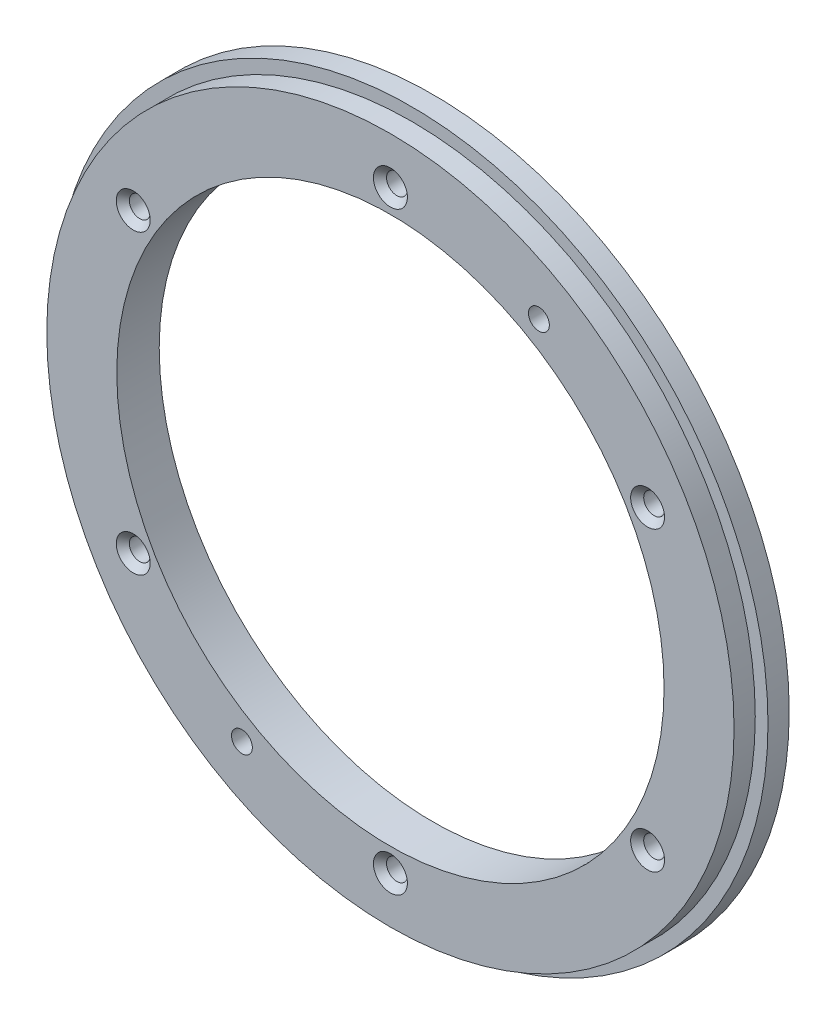
ISO-10303-21;
HEADER;
FILE_DESCRIPTION(('STEP AP214'),'2;1');
FILE_NAME('part.step','',(''),(''),'','','');
FILE_SCHEMA(('AUTOMOTIVE_DESIGN { 1 0 10303 214 1 1 1 1 }'));
ENDSEC;
DATA;
#1=APPLICATION_CONTEXT('core data for automotive mechanical design processes');
#2=APPLICATION_PROTOCOL_DEFINITION('international standard','automotive_design',2000,#1);
#3=PRODUCT_CONTEXT('',#1,'mechanical');
#4=PRODUCT('Part','Part','',(#3));
#5=PRODUCT_RELATED_PRODUCT_CATEGORY('part','',(#4));
#6=PRODUCT_DEFINITION_FORMATION('','',#4);
#7=PRODUCT_DEFINITION_CONTEXT('part definition',#1,'design');
#8=PRODUCT_DEFINITION('design','',#6,#7);
#9=PRODUCT_DEFINITION_SHAPE('','',#8);
#10=(LENGTH_UNIT() NAMED_UNIT(*) SI_UNIT(.MILLI.,.METRE.));
#11=(NAMED_UNIT(*) PLANE_ANGLE_UNIT() SI_UNIT($,.RADIAN.));
#12=(NAMED_UNIT(*) SI_UNIT($,.STERADIAN.) SOLID_ANGLE_UNIT());
#13=UNCERTAINTY_MEASURE_WITH_UNIT(LENGTH_MEASURE(1.E-05),#10,'distance_accuracy_value','');
#14=(GEOMETRIC_REPRESENTATION_CONTEXT(3) GLOBAL_UNCERTAINTY_ASSIGNED_CONTEXT((#13)) GLOBAL_UNIT_ASSIGNED_CONTEXT((#10,
#11,#12)) REPRESENTATION_CONTEXT('',''));
#15=CARTESIAN_POINT('',(0.,0.,0.));
#16=DIRECTION('',(0.,0.,1.));
#17=DIRECTION('',(1.,0.,0.));
#18=AXIS2_PLACEMENT_3D('',#15,#16,#17);
#19=CARTESIAN_POINT('',(0.,0.,2.5));
#20=DIRECTION('',(0.,0.,1.));
#21=DIRECTION('',(1.,0.,0.));
#22=AXIS2_PLACEMENT_3D('',#19,#20,#21);
#23=CYLINDRICAL_SURFACE('',#22,40.5);
#24=CARTESIAN_POINT('',(0.,0.,2.5));
#25=DIRECTION('',(0.,0.,1.));
#26=DIRECTION('',(1.,0.,0.));
#27=AXIS2_PLACEMENT_3D('',#24,#25,#26);
#28=CIRCLE('',#27,40.5);
#29=CARTESIAN_POINT('',(40.5,0.,2.5));
#30=VERTEX_POINT('',#29);
#31=EDGE_CURVE('E62',#30,#30,#28,.T.);
#32=ORIENTED_EDGE('',*,*,#31,.T.);
#33=EDGE_LOOP('',(#32));
#34=FACE_BOUND('',#33,.T.);
#35=CARTESIAN_POINT('',(0.,0.,5.));
#36=DIRECTION('',(0.,0.,1.));
#37=DIRECTION('',(1.,0.,0.));
#38=AXIS2_PLACEMENT_3D('',#35,#36,#37);
#39=CIRCLE('',#38,40.5);
#40=CARTESIAN_POINT('',(40.5,0.,5.));
#41=VERTEX_POINT('',#40);
#42=EDGE_CURVE('E65',#41,#41,#39,.F.);
#43=ORIENTED_EDGE('',*,*,#42,.T.);
#44=EDGE_LOOP('',(#43));
#45=FACE_BOUND('',#44,.T.);
#46=ADVANCED_FACE('F14',(#34,#45),#23,.T.);
#47=CARTESIAN_POINT('',(17.5,30.3108891324553,4.));
#48=DIRECTION('',(0.,0.,-1.));
#49=DIRECTION('',(-1.,0.,0.));
#50=AXIS2_PLACEMENT_3D('',#47,#48,#49);
#51=CYLINDRICAL_SURFACE('',#50,1.2295);
#52=CARTESIAN_POINT('',(17.5,30.3108891324553,0.770500000044194));
#53=DIRECTION('',(0.,0.,-1.));
#54=DIRECTION('',(-1.,0.,0.));
#55=AXIS2_PLACEMENT_3D('',#52,#53,#54);
#56=CIRCLE('',#55,1.22949999998128);
#57=CARTESIAN_POINT('',(16.2705000000187,30.3108891324553,0.770500000044194));
#58=VERTEX_POINT('',#57);
#59=EDGE_CURVE('E29',#58,#58,#56,.T.);
#60=ORIENTED_EDGE('',*,*,#59,.T.);
#61=EDGE_LOOP('',(#60));
#62=FACE_BOUND('',#61,.T.);
#63=CARTESIAN_POINT('',(17.5,30.3108891324553,5.));
#64=DIRECTION('',(0.,0.,-1.));
#65=DIRECTION('',(-1.,0.,0.));
#66=AXIS2_PLACEMENT_3D('',#63,#64,#65);
#67=CIRCLE('',#66,1.2295);
#68=CARTESIAN_POINT('',(16.2705,30.3108891324553,5.));
#69=VERTEX_POINT('',#68);
#70=EDGE_CURVE('E17',#69,#69,#67,.F.);
#71=ORIENTED_EDGE('',*,*,#70,.T.);
#72=EDGE_LOOP('',(#71));
#73=FACE_BOUND('',#72,.T.);
#74=ADVANCED_FACE('F92',(#62,#73),#51,.F.);
#75=CARTESIAN_POINT('',(-17.5,-30.3108891324553,4.));
#76=DIRECTION('',(0.,0.,-1.));
#77=DIRECTION('',(-1.,0.,0.));
#78=AXIS2_PLACEMENT_3D('',#75,#76,#77);
#79=CYLINDRICAL_SURFACE('',#78,1.2295);
#80=CARTESIAN_POINT('',(-17.5,-30.3108891324553,0.770499999987351));
#81=DIRECTION('',(0.,0.,-1.));
#82=DIRECTION('',(-1.,0.,0.));
#83=AXIS2_PLACEMENT_3D('',#80,#81,#82);
#84=CIRCLE('',#83,1.22950000006311);
#85=CARTESIAN_POINT('',(-18.7295000000631,-30.3108891324553,0.770499999987351));
#86=VERTEX_POINT('',#85);
#87=EDGE_CURVE('E165',#86,#86,#84,.T.);
#88=ORIENTED_EDGE('',*,*,#87,.T.);
#89=EDGE_LOOP('',(#88));
#90=FACE_BOUND('',#89,.T.);
#91=CARTESIAN_POINT('',(-17.5,-30.3108891324553,5.));
#92=DIRECTION('',(0.,0.,-1.));
#93=DIRECTION('',(-1.,0.,0.));
#94=AXIS2_PLACEMENT_3D('',#91,#92,#93);
#95=CIRCLE('',#94,1.2295);
#96=CARTESIAN_POINT('',(-18.7295,-30.3108891324553,5.));
#97=VERTEX_POINT('',#96);
#98=EDGE_CURVE('E85',#97,#97,#95,.F.);
#99=ORIENTED_EDGE('',*,*,#98,.T.);
#100=EDGE_LOOP('',(#99));
#101=FACE_BOUND('',#100,.T.);
#102=ADVANCED_FACE('F233',(#90,#101),#79,.F.);
#103=CARTESIAN_POINT('',(-30.3108891324554,-17.5,4.99999999999545));
#104=DIRECTION('',(0.,0.,1.));
#105=DIRECTION('',(1.,0.,0.));
#106=AXIS2_PLACEMENT_3D('',#103,#104,#105);
#107=CONICAL_SURFACE('',#106,1.99999999994257,0.785398163397448);
#108=CARTESIAN_POINT('',(-30.3108891324554,-17.5,4.99999999999545));
#109=DIRECTION('',(0.,0.,1.));
#110=DIRECTION('',(1.,0.,0.));
#111=AXIS2_PLACEMENT_3D('',#108,#109,#110);
#112=CIRCLE('',#111,1.99999999994257);
#113=CARTESIAN_POINT('',(-28.3108891325128,-17.5,4.99999999999545));
#114=VERTEX_POINT('',#113);
#115=EDGE_CURVE('E83',#114,#114,#112,.T.);
#116=ORIENTED_EDGE('',*,*,#115,.T.);
#117=EDGE_LOOP('',(#116));
#118=FACE_BOUND('',#117,.T.);
#119=CARTESIAN_POINT('',(-30.3108891324554,-17.5,4.2295));
#120=DIRECTION('',(0.,0.,1.));
#121=DIRECTION('',(1.,0.,0.));
#122=AXIS2_PLACEMENT_3D('',#119,#120,#121);
#123=CIRCLE('',#122,1.2295);
#124=CARTESIAN_POINT('',(-29.0813891324553,-17.5,4.2295));
#125=VERTEX_POINT('',#124);
#126=EDGE_CURVE('E167',#125,#125,#123,.F.);
#127=ORIENTED_EDGE('',*,*,#126,.T.);
#128=EDGE_LOOP('',(#127));
#129=FACE_BOUND('',#128,.T.);
#130=ADVANCED_FACE('F229',(#118,#129),#107,.F.);
#131=CARTESIAN_POINT('',(30.3108891324554,-17.5,4.99999999999545));
#132=DIRECTION('',(0.,0.,1.));
#133=DIRECTION('',(1.,0.,0.));
#134=AXIS2_PLACEMENT_3D('',#131,#132,#133);
#135=CONICAL_SURFACE('',#134,1.99999999996284,0.785398163397448);
#136=CARTESIAN_POINT('',(30.3108891324554,-17.5,4.99999999999545));
#137=DIRECTION('',(0.,0.,1.));
#138=DIRECTION('',(1.,0.,0.));
#139=AXIS2_PLACEMENT_3D('',#136,#137,#138);
#140=CIRCLE('',#139,1.99999999996284);
#141=CARTESIAN_POINT('',(32.3108891324182,-17.5,4.99999999999545));
#142=VERTEX_POINT('',#141);
#143=EDGE_CURVE('E80',#142,#142,#140,.T.);
#144=ORIENTED_EDGE('',*,*,#143,.T.);
#145=EDGE_LOOP('',(#144));
#146=FACE_BOUND('',#145,.T.);
#147=CARTESIAN_POINT('',(30.3108891324554,-17.5,4.2295));
#148=DIRECTION('',(0.,0.,1.));
#149=DIRECTION('',(1.,0.,0.));
#150=AXIS2_PLACEMENT_3D('',#147,#148,#149);
#151=CIRCLE('',#150,1.2295);
#152=CARTESIAN_POINT('',(31.5403891324554,-17.5,4.2295));
#153=VERTEX_POINT('',#152);
#154=EDGE_CURVE('E171',#153,#153,#151,.F.);
#155=ORIENTED_EDGE('',*,*,#154,.T.);
#156=EDGE_LOOP('',(#155));
#157=FACE_BOUND('',#156,.T.);
#158=ADVANCED_FACE('F225',(#146,#157),#135,.F.);
#159=CARTESIAN_POINT('',(0.,35.,4.99999999999545));
#160=DIRECTION('',(0.,0.,1.));
#161=DIRECTION('',(1.,0.,0.));
#162=AXIS2_PLACEMENT_3D('',#159,#160,#161);
#163=CONICAL_SURFACE('',#162,2.00000000000955,0.785398163434336);
#164=CARTESIAN_POINT('',(0.,35.,4.99999999999545));
#165=DIRECTION('',(0.,0.,1.));
#166=DIRECTION('',(1.,0.,0.));
#167=AXIS2_PLACEMENT_3D('',#164,#165,#166);
#168=CIRCLE('',#167,2.00000000000955);
#169=CARTESIAN_POINT('',(2.00000000000955,35.,4.99999999999545));
#170=VERTEX_POINT('',#169);
#171=EDGE_CURVE('E77',#170,#170,#168,.T.);
#172=ORIENTED_EDGE('',*,*,#171,.T.);
#173=EDGE_LOOP('',(#172));
#174=FACE_BOUND('',#173,.T.);
#175=CARTESIAN_POINT('',(0.,35.,4.2295));
#176=DIRECTION('',(0.,0.,1.));
#177=DIRECTION('',(1.,0.,0.));
#178=AXIS2_PLACEMENT_3D('',#175,#176,#177);
#179=CIRCLE('',#178,1.2295);
#180=CARTESIAN_POINT('',(1.2295,35.,4.2295));
#181=VERTEX_POINT('',#180);
#182=EDGE_CURVE('E176',#181,#181,#179,.F.);
#183=ORIENTED_EDGE('',*,*,#182,.T.);
#184=EDGE_LOOP('',(#183));
#185=FACE_BOUND('',#184,.T.);
#186=ADVANCED_FACE('F219',(#174,#185),#163,.F.);
#187=CARTESIAN_POINT('',(30.3108891324554,17.5,4.99999999999545));
#188=DIRECTION('',(0.,0.,1.));
#189=DIRECTION('',(1.,0.,0.));
#190=AXIS2_PLACEMENT_3D('',#187,#188,#189);
#191=CONICAL_SURFACE('',#190,1.99999999996285,0.785398163397448);
#192=CARTESIAN_POINT('',(30.3108891324554,17.5,4.99999999999545));
#193=DIRECTION('',(0.,0.,1.));
#194=DIRECTION('',(1.,0.,0.));
#195=AXIS2_PLACEMENT_3D('',#192,#193,#194);
#196=CIRCLE('',#195,1.99999999996285);
#197=CARTESIAN_POINT('',(32.3108891324182,17.5,4.99999999999545));
#198=VERTEX_POINT('',#197);
#199=EDGE_CURVE('E74',#198,#198,#196,.T.);
#200=ORIENTED_EDGE('',*,*,#199,.T.);
#201=EDGE_LOOP('',(#200));
#202=FACE_BOUND('',#201,.T.);
#203=CARTESIAN_POINT('',(30.3108891324554,17.5,4.2295));
#204=DIRECTION('',(0.,0.,1.));
#205=DIRECTION('',(1.,0.,0.));
#206=AXIS2_PLACEMENT_3D('',#203,#204,#205);
#207=CIRCLE('',#206,1.2295);
#208=CARTESIAN_POINT('',(31.5403891324553,17.5,4.2295));
#209=VERTEX_POINT('',#208);
#210=EDGE_CURVE('E179',#209,#209,#207,.F.);
#211=ORIENTED_EDGE('',*,*,#210,.T.);
#212=EDGE_LOOP('',(#211));
#213=FACE_BOUND('',#212,.T.);
#214=ADVANCED_FACE('F213',(#202,#213),#191,.F.);
#215=CARTESIAN_POINT('',(0.,-35.,4.99999999999545));
#216=DIRECTION('',(0.,0.,1.));
#217=DIRECTION('',(1.,0.,0.));
#218=AXIS2_PLACEMENT_3D('',#215,#216,#217);
#219=CONICAL_SURFACE('',#218,2.00000000000955,0.785398163434336);
#220=CARTESIAN_POINT('',(0.,-35.,4.99999999999545));
#221=DIRECTION('',(0.,0.,1.));
#222=DIRECTION('',(1.,0.,0.));
#223=AXIS2_PLACEMENT_3D('',#220,#221,#222);
#224=CIRCLE('',#223,2.00000000000955);
#225=CARTESIAN_POINT('',(2.00000000000955,-35.,4.99999999999545));
#226=VERTEX_POINT('',#225);
#227=EDGE_CURVE('E71',#226,#226,#224,.T.);
#228=ORIENTED_EDGE('',*,*,#227,.T.);
#229=EDGE_LOOP('',(#228));
#230=FACE_BOUND('',#229,.T.);
#231=CARTESIAN_POINT('',(0.,-35.,4.2295));
#232=DIRECTION('',(0.,0.,1.));
#233=DIRECTION('',(1.,0.,0.));
#234=AXIS2_PLACEMENT_3D('',#231,#232,#233);
#235=CIRCLE('',#234,1.2295);
#236=CARTESIAN_POINT('',(1.2295,-35.,4.2295));
#237=VERTEX_POINT('',#236);
#238=EDGE_CURVE('E182',#237,#237,#235,.F.);
#239=ORIENTED_EDGE('',*,*,#238,.T.);
#240=EDGE_LOOP('',(#239));
#241=FACE_BOUND('',#240,.T.);
#242=ADVANCED_FACE('F108',(#230,#241),#219,.F.);
#243=CARTESIAN_POINT('',(-30.3108891324554,17.5,4.99999999999545));
#244=DIRECTION('',(0.,0.,1.));
#245=DIRECTION('',(1.,0.,0.));
#246=AXIS2_PLACEMENT_3D('',#243,#244,#245);
#247=CONICAL_SURFACE('',#246,1.99999999994257,0.785398163397448);
#248=CARTESIAN_POINT('',(-30.3108891324554,17.5,4.99999999999545));
#249=DIRECTION('',(0.,0.,1.));
#250=DIRECTION('',(1.,0.,0.));
#251=AXIS2_PLACEMENT_3D('',#248,#249,#250);
#252=CIRCLE('',#251,1.99999999994257);
#253=CARTESIAN_POINT('',(-28.3108891325128,17.5,4.99999999999545));
#254=VERTEX_POINT('',#253);
#255=EDGE_CURVE('E68',#254,#254,#252,.T.);
#256=ORIENTED_EDGE('',*,*,#255,.T.);
#257=EDGE_LOOP('',(#256));
#258=FACE_BOUND('',#257,.T.);
#259=CARTESIAN_POINT('',(-30.3108891324554,17.5,4.2295));
#260=DIRECTION('',(0.,0.,1.));
#261=DIRECTION('',(1.,0.,0.));
#262=AXIS2_PLACEMENT_3D('',#259,#260,#261);
#263=CIRCLE('',#262,1.2295);
#264=CARTESIAN_POINT('',(-29.0813891324554,17.5,4.2295));
#265=VERTEX_POINT('',#264);
#266=EDGE_CURVE('E61',#265,#265,#263,.F.);
#267=ORIENTED_EDGE('',*,*,#266,.T.);
#268=EDGE_LOOP('',(#267));
#269=FACE_BOUND('',#268,.T.);
#270=ADVANCED_FACE('F97',(#258,#269),#247,.F.);
#271=CARTESIAN_POINT('',(0.,0.,5.));
#272=DIRECTION('',(0.,0.,-1.));
#273=DIRECTION('',(-1.,0.,0.));
#274=AXIS2_PLACEMENT_3D('',#271,#272,#273);
#275=PLANE('',#274);
#276=ORIENTED_EDGE('',*,*,#42,.F.);
#277=EDGE_LOOP('',(#276));
#278=FACE_BOUND('',#277,.T.);
#279=CARTESIAN_POINT('',(0.,0.,5.));
#280=DIRECTION('',(0.,0.,1.));
#281=DIRECTION('',(1.,0.,0.));
#282=AXIS2_PLACEMENT_3D('',#279,#280,#281);
#283=CIRCLE('',#282,32.25);
#284=CARTESIAN_POINT('',(32.25,0.,5.));
#285=VERTEX_POINT('',#284);
#286=EDGE_CURVE('E58',#285,#285,#283,.F.);
#287=ORIENTED_EDGE('',*,*,#286,.T.);
#288=EDGE_LOOP('',(#287));
#289=FACE_BOUND('',#288,.T.);
#290=ORIENTED_EDGE('',*,*,#255,.F.);
#291=EDGE_LOOP('',(#290));
#292=FACE_BOUND('',#291,.T.);
#293=ORIENTED_EDGE('',*,*,#227,.F.);
#294=EDGE_LOOP('',(#293));
#295=FACE_BOUND('',#294,.T.);
#296=ORIENTED_EDGE('',*,*,#199,.F.);
#297=EDGE_LOOP('',(#296));
#298=FACE_BOUND('',#297,.T.);
#299=ORIENTED_EDGE('',*,*,#171,.F.);
#300=EDGE_LOOP('',(#299));
#301=FACE_BOUND('',#300,.T.);
#302=ORIENTED_EDGE('',*,*,#143,.F.);
#303=EDGE_LOOP('',(#302));
#304=FACE_BOUND('',#303,.T.);
#305=ORIENTED_EDGE('',*,*,#115,.F.);
#306=EDGE_LOOP('',(#305));
#307=FACE_BOUND('',#306,.T.);
#308=ORIENTED_EDGE('',*,*,#98,.F.);
#309=EDGE_LOOP('',(#308));
#310=FACE_BOUND('',#309,.T.);
#311=ORIENTED_EDGE('',*,*,#70,.F.);
#312=EDGE_LOOP('',(#311));
#313=FACE_BOUND('',#312,.T.);
#314=ADVANCED_FACE('F94',(#278,#289,#292,#295,#298,#301,#304,#307,#310,#313),#275,.F.);
#315=CARTESIAN_POINT('',(0.,0.,2.5));
#316=DIRECTION('',(0.,0.,-1.));
#317=DIRECTION('',(-1.,0.,0.));
#318=AXIS2_PLACEMENT_3D('',#315,#316,#317);
#319=PLANE('',#318);
#320=CARTESIAN_POINT('',(0.,0.,2.5));
#321=DIRECTION('',(0.,0.,1.));
#322=DIRECTION('',(1.,0.,0.));
#323=AXIS2_PLACEMENT_3D('',#320,#321,#322);
#324=CIRCLE('',#323,42.);
#325=CARTESIAN_POINT('',(42.,0.,2.5));
#326=VERTEX_POINT('',#325);
#327=EDGE_CURVE('E55',#326,#326,#324,.F.);
#328=ORIENTED_EDGE('',*,*,#327,.F.);
#329=EDGE_LOOP('',(#328));
#330=FACE_BOUND('',#329,.T.);
#331=ORIENTED_EDGE('',*,*,#31,.F.);
#332=EDGE_LOOP('',(#331));
#333=FACE_BOUND('',#332,.T.);
#334=ADVANCED_FACE('F96',(#330,#333),#319,.F.);
#335=CARTESIAN_POINT('',(17.5,30.3108891324553,0.));
#336=DIRECTION('',(0.,0.,-1.));
#337=DIRECTION('',(-1.,0.,0.));
#338=AXIS2_PLACEMENT_3D('',#335,#336,#337);
#339=CONICAL_SURFACE('',#338,2.00000000008232,0.785398163434336);
#340=CARTESIAN_POINT('',(17.5,30.3108891324553,1.59282309552439E-11));
#341=DIRECTION('',(0.,0.,-1.));
#342=DIRECTION('',(-1.,0.,0.));
#343=AXIS2_PLACEMENT_3D('',#340,#341,#342);
#344=CIRCLE('',#343,2.00000000006639);
#345=CARTESIAN_POINT('',(15.4999999999336,30.3108891324553,1.59282309552439E-11));
#346=VERTEX_POINT('',#345);
#347=EDGE_CURVE('E52',#346,#346,#344,.F.);
#348=ORIENTED_EDGE('',*,*,#347,.F.);
#349=EDGE_LOOP('',(#348));
#350=FACE_BOUND('',#349,.T.);
#351=ORIENTED_EDGE('',*,*,#59,.F.);
#352=EDGE_LOOP('',(#351));
#353=FACE_BOUND('',#352,.T.);
#354=ADVANCED_FACE('F105',(#350,#353),#339,.F.);
#355=CARTESIAN_POINT('',(-17.5,-30.3108891324553,5.6843418860808E-11));
#356=DIRECTION('',(0.,0.,-1.));
#357=DIRECTION('',(-1.,0.,0.));
#358=AXIS2_PLACEMENT_3D('',#355,#356,#357);
#359=CONICAL_SURFACE('',#358,1.99999999999361,0.785398163397448);
#360=CARTESIAN_POINT('',(-17.5,-30.3108891324553,5.6843418860808E-11));
#361=DIRECTION('',(0.,0.,-1.));
#362=DIRECTION('',(-1.,0.,0.));
#363=AXIS2_PLACEMENT_3D('',#360,#361,#362);
#364=CIRCLE('',#363,1.99999999999361);
#365=CARTESIAN_POINT('',(-19.4999999999936,-30.3108891324553,5.6843418860808E-11));
#366=VERTEX_POINT('',#365);
#367=EDGE_CURVE('E49',#366,#366,#364,.F.);
#368=ORIENTED_EDGE('',*,*,#367,.F.);
#369=EDGE_LOOP('',(#368));
#370=FACE_BOUND('',#369,.T.);
#371=ORIENTED_EDGE('',*,*,#87,.F.);
#372=EDGE_LOOP('',(#371));
#373=FACE_BOUND('',#372,.T.);
#374=ADVANCED_FACE('F151',(#370,#373),#359,.F.);
#375=CARTESIAN_POINT('',(-30.3108891324554,-17.5,1.));
#376=DIRECTION('',(0.,0.,1.));
#377=DIRECTION('',(1.,0.,0.));
#378=AXIS2_PLACEMENT_3D('',#375,#376,#377);
#379=CYLINDRICAL_SURFACE('',#378,1.2295);
#380=ORIENTED_EDGE('',*,*,#126,.F.);
#381=EDGE_LOOP('',(#380));
#382=FACE_BOUND('',#381,.T.);
#383=CARTESIAN_POINT('',(-30.3108891324554,-17.5,0.));
#384=DIRECTION('',(0.,0.,1.));
#385=DIRECTION('',(1.,0.,0.));
#386=AXIS2_PLACEMENT_3D('',#383,#384,#385);
#387=CIRCLE('',#386,1.2295);
#388=CARTESIAN_POINT('',(-29.0813891324553,-17.5,0.));
#389=VERTEX_POINT('',#388);
#390=EDGE_CURVE('E46',#389,#389,#387,.T.);
#391=ORIENTED_EDGE('',*,*,#390,.F.);
#392=EDGE_LOOP('',(#391));
#393=FACE_BOUND('',#392,.T.);
#394=ADVANCED_FACE('F147',(#382,#393),#379,.F.);
#395=CARTESIAN_POINT('',(30.3108891324554,-17.5,1.));
#396=DIRECTION('',(0.,0.,1.));
#397=DIRECTION('',(1.,0.,0.));
#398=AXIS2_PLACEMENT_3D('',#395,#396,#397);
#399=CYLINDRICAL_SURFACE('',#398,1.2295);
#400=ORIENTED_EDGE('',*,*,#154,.F.);
#401=EDGE_LOOP('',(#400));
#402=FACE_BOUND('',#401,.T.);
#403=CARTESIAN_POINT('',(30.3108891324554,-17.5,0.));
#404=DIRECTION('',(0.,0.,1.));
#405=DIRECTION('',(1.,0.,0.));
#406=AXIS2_PLACEMENT_3D('',#403,#404,#405);
#407=CIRCLE('',#406,1.2295);
#408=CARTESIAN_POINT('',(31.5403891324554,-17.5,0.));
#409=VERTEX_POINT('',#408);
#410=EDGE_CURVE('E43',#409,#409,#407,.T.);
#411=ORIENTED_EDGE('',*,*,#410,.F.);
#412=EDGE_LOOP('',(#411));
#413=FACE_BOUND('',#412,.T.);
#414=ADVANCED_FACE('F143',(#402,#413),#399,.F.);
#415=CARTESIAN_POINT('',(0.,35.,1.));
#416=DIRECTION('',(0.,0.,1.));
#417=DIRECTION('',(1.,0.,0.));
#418=AXIS2_PLACEMENT_3D('',#415,#416,#417);
#419=CYLINDRICAL_SURFACE('',#418,1.2295);
#420=ORIENTED_EDGE('',*,*,#182,.F.);
#421=EDGE_LOOP('',(#420));
#422=FACE_BOUND('',#421,.T.);
#423=CARTESIAN_POINT('',(0.,35.,0.));
#424=DIRECTION('',(0.,0.,1.));
#425=DIRECTION('',(1.,0.,0.));
#426=AXIS2_PLACEMENT_3D('',#423,#424,#425);
#427=CIRCLE('',#426,1.2295);
#428=CARTESIAN_POINT('',(1.2295,35.,0.));
#429=VERTEX_POINT('',#428);
#430=EDGE_CURVE('E40',#429,#429,#427,.T.);
#431=ORIENTED_EDGE('',*,*,#430,.F.);
#432=EDGE_LOOP('',(#431));
#433=FACE_BOUND('',#432,.T.);
#434=ADVANCED_FACE('F139',(#422,#433),#419,.F.);
#435=CARTESIAN_POINT('',(30.3108891324554,17.5,1.));
#436=DIRECTION('',(0.,0.,1.));
#437=DIRECTION('',(1.,0.,0.));
#438=AXIS2_PLACEMENT_3D('',#435,#436,#437);
#439=CYLINDRICAL_SURFACE('',#438,1.2295);
#440=ORIENTED_EDGE('',*,*,#210,.F.);
#441=EDGE_LOOP('',(#440));
#442=FACE_BOUND('',#441,.T.);
#443=CARTESIAN_POINT('',(30.3108891324554,17.5,0.));
#444=DIRECTION('',(0.,0.,1.));
#445=DIRECTION('',(1.,0.,0.));
#446=AXIS2_PLACEMENT_3D('',#443,#444,#445);
#447=CIRCLE('',#446,1.2295);
#448=CARTESIAN_POINT('',(31.5403891324553,17.5,0.));
#449=VERTEX_POINT('',#448);
#450=EDGE_CURVE('E37',#449,#449,#447,.T.);
#451=ORIENTED_EDGE('',*,*,#450,.F.);
#452=EDGE_LOOP('',(#451));
#453=FACE_BOUND('',#452,.T.);
#454=ADVANCED_FACE('F135',(#442,#453),#439,.F.);
#455=CARTESIAN_POINT('',(0.,-35.,1.));
#456=DIRECTION('',(0.,0.,1.));
#457=DIRECTION('',(1.,0.,0.));
#458=AXIS2_PLACEMENT_3D('',#455,#456,#457);
#459=CYLINDRICAL_SURFACE('',#458,1.2295);
#460=ORIENTED_EDGE('',*,*,#238,.F.);
#461=EDGE_LOOP('',(#460));
#462=FACE_BOUND('',#461,.T.);
#463=CARTESIAN_POINT('',(0.,-35.,0.));
#464=DIRECTION('',(0.,0.,1.));
#465=DIRECTION('',(1.,0.,0.));
#466=AXIS2_PLACEMENT_3D('',#463,#464,#465);
#467=CIRCLE('',#466,1.2295);
#468=CARTESIAN_POINT('',(1.2295,-35.,0.));
#469=VERTEX_POINT('',#468);
#470=EDGE_CURVE('E34',#469,#469,#467,.T.);
#471=ORIENTED_EDGE('',*,*,#470,.F.);
#472=EDGE_LOOP('',(#471));
#473=FACE_BOUND('',#472,.T.);
#474=ADVANCED_FACE('F131',(#462,#473),#459,.F.);
#475=CARTESIAN_POINT('',(-30.3108891324554,17.5,1.));
#476=DIRECTION('',(0.,0.,1.));
#477=DIRECTION('',(1.,0.,0.));
#478=AXIS2_PLACEMENT_3D('',#475,#476,#477);
#479=CYLINDRICAL_SURFACE('',#478,1.2295);
#480=ORIENTED_EDGE('',*,*,#266,.F.);
#481=EDGE_LOOP('',(#480));
#482=FACE_BOUND('',#481,.T.);
#483=CARTESIAN_POINT('',(-30.3108891324554,17.5,0.));
#484=DIRECTION('',(0.,0.,1.));
#485=DIRECTION('',(1.,0.,0.));
#486=AXIS2_PLACEMENT_3D('',#483,#484,#485);
#487=CIRCLE('',#486,1.2295);
#488=CARTESIAN_POINT('',(-29.0813891324554,17.5,0.));
#489=VERTEX_POINT('',#488);
#490=EDGE_CURVE('E26',#489,#489,#487,.T.);
#491=ORIENTED_EDGE('',*,*,#490,.F.);
#492=EDGE_LOOP('',(#491));
#493=FACE_BOUND('',#492,.T.);
#494=ADVANCED_FACE('F127',(#482,#493),#479,.F.);
#495=CARTESIAN_POINT('',(0.,0.,1.));
#496=DIRECTION('',(0.,0.,1.));
#497=DIRECTION('',(1.,0.,0.));
#498=AXIS2_PLACEMENT_3D('',#495,#496,#497);
#499=CYLINDRICAL_SURFACE('',#498,32.25);
#500=ORIENTED_EDGE('',*,*,#286,.F.);
#501=EDGE_LOOP('',(#500));
#502=FACE_BOUND('',#501,.T.);
#503=CARTESIAN_POINT('',(0.,0.,0.));
#504=DIRECTION('',(0.,0.,1.));
#505=DIRECTION('',(1.,0.,0.));
#506=AXIS2_PLACEMENT_3D('',#503,#504,#505);
#507=CIRCLE('',#506,32.25);
#508=CARTESIAN_POINT('',(32.25,0.,0.));
#509=VERTEX_POINT('',#508);
#510=EDGE_CURVE('E21',#509,#509,#507,.T.);
#511=ORIENTED_EDGE('',*,*,#510,.F.);
#512=EDGE_LOOP('',(#511));
#513=FACE_BOUND('',#512,.T.);
#514=ADVANCED_FACE('F120',(#502,#513),#499,.F.);
#515=CARTESIAN_POINT('',(0.,0.,0.));
#516=DIRECTION('',(0.,0.,1.));
#517=DIRECTION('',(1.,0.,0.));
#518=AXIS2_PLACEMENT_3D('',#515,#516,#517);
#519=CYLINDRICAL_SURFACE('',#518,42.);
#520=ORIENTED_EDGE('',*,*,#327,.T.);
#521=EDGE_LOOP('',(#520));
#522=FACE_BOUND('',#521,.T.);
#523=CARTESIAN_POINT('',(0.,0.,0.));
#524=DIRECTION('',(0.,0.,1.));
#525=DIRECTION('',(1.,0.,0.));
#526=AXIS2_PLACEMENT_3D('',#523,#524,#525);
#527=CIRCLE('',#526,42.);
#528=CARTESIAN_POINT('',(42.,0.,0.));
#529=VERTEX_POINT('',#528);
#530=EDGE_CURVE('E9',#529,#529,#527,.F.);
#531=ORIENTED_EDGE('',*,*,#530,.F.);
#532=EDGE_LOOP('',(#531));
#533=FACE_BOUND('',#532,.T.);
#534=ADVANCED_FACE('F115',(#522,#533),#519,.T.);
#535=CARTESIAN_POINT('',(0.,0.,0.));
#536=DIRECTION('',(0.,0.,-1.));
#537=DIRECTION('',(-1.,0.,0.));
#538=AXIS2_PLACEMENT_3D('',#535,#536,#537);
#539=PLANE('',#538);
#540=ORIENTED_EDGE('',*,*,#530,.T.);
#541=EDGE_LOOP('',(#540));
#542=FACE_BOUND('',#541,.T.);
#543=ORIENTED_EDGE('',*,*,#510,.T.);
#544=EDGE_LOOP('',(#543));
#545=FACE_BOUND('',#544,.T.);
#546=ORIENTED_EDGE('',*,*,#490,.T.);
#547=EDGE_LOOP('',(#546));
#548=FACE_BOUND('',#547,.T.);
#549=ORIENTED_EDGE('',*,*,#470,.T.);
#550=EDGE_LOOP('',(#549));
#551=FACE_BOUND('',#550,.T.);
#552=ORIENTED_EDGE('',*,*,#450,.T.);
#553=EDGE_LOOP('',(#552));
#554=FACE_BOUND('',#553,.T.);
#555=ORIENTED_EDGE('',*,*,#430,.T.);
#556=EDGE_LOOP('',(#555));
#557=FACE_BOUND('',#556,.T.);
#558=ORIENTED_EDGE('',*,*,#410,.T.);
#559=EDGE_LOOP('',(#558));
#560=FACE_BOUND('',#559,.T.);
#561=ORIENTED_EDGE('',*,*,#390,.T.);
#562=EDGE_LOOP('',(#561));
#563=FACE_BOUND('',#562,.T.);
#564=ORIENTED_EDGE('',*,*,#367,.T.);
#565=EDGE_LOOP('',(#564));
#566=FACE_BOUND('',#565,.T.);
#567=ORIENTED_EDGE('',*,*,#347,.T.);
#568=EDGE_LOOP('',(#567));
#569=FACE_BOUND('',#568,.T.);
#570=ADVANCED_FACE('F113',(#542,#545,#548,#551,#554,#557,#560,#563,#566,#569),#539,.T.);
#571=CLOSED_SHELL('',(#46,#74,#102,#130,#158,#186,#214,#242,#270,#314,#334,#354,#374,#394,#414,
#434,#454,#474,#494,#514,#534,#570));
#572=MANIFOLD_SOLID_BREP('B1',#571);
#573=ADVANCED_BREP_SHAPE_REPRESENTATION('',(#18,#572),#14);
#574=SHAPE_DEFINITION_REPRESENTATION(#9,#573);
ENDSEC;
END-ISO-10303-21;
